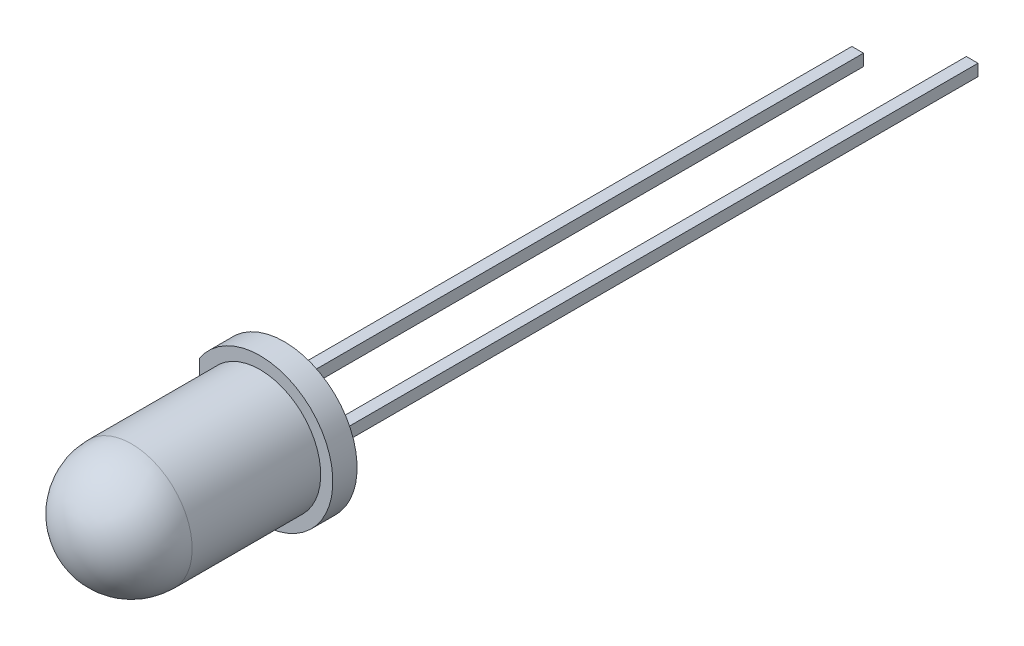
ISO-10303-21;
HEADER;
FILE_DESCRIPTION(('STEP AP214'),'2;1');
FILE_NAME('part.step','',(''),(''),'','','');
FILE_SCHEMA(('AUTOMOTIVE_DESIGN { 1 0 10303 214 1 1 1 1 }'));
ENDSEC;
DATA;
#1=APPLICATION_CONTEXT('core data for automotive mechanical design processes');
#2=APPLICATION_PROTOCOL_DEFINITION('international standard','automotive_design',2000,#1);
#3=PRODUCT_CONTEXT('',#1,'mechanical');
#4=PRODUCT('Part','Part','',(#3));
#5=PRODUCT_RELATED_PRODUCT_CATEGORY('part','',(#4));
#6=PRODUCT_DEFINITION_FORMATION('','',#4);
#7=PRODUCT_DEFINITION_CONTEXT('part definition',#1,'design');
#8=PRODUCT_DEFINITION('design','',#6,#7);
#9=PRODUCT_DEFINITION_SHAPE('','',#8);
#10=(LENGTH_UNIT() NAMED_UNIT(*) SI_UNIT(.MILLI.,.METRE.));
#11=(NAMED_UNIT(*) PLANE_ANGLE_UNIT() SI_UNIT($,.RADIAN.));
#12=(NAMED_UNIT(*) SI_UNIT($,.STERADIAN.) SOLID_ANGLE_UNIT());
#13=UNCERTAINTY_MEASURE_WITH_UNIT(LENGTH_MEASURE(1.E-05),#10,'distance_accuracy_value','');
#14=(GEOMETRIC_REPRESENTATION_CONTEXT(3) GLOBAL_UNCERTAINTY_ASSIGNED_CONTEXT((#13)) GLOBAL_UNIT_ASSIGNED_CONTEXT((#10,
#11,#12)) REPRESENTATION_CONTEXT('',''));
#15=CARTESIAN_POINT('',(0.,0.,0.));
#16=DIRECTION('',(0.,0.,1.));
#17=DIRECTION('',(1.,0.,0.));
#18=AXIS2_PLACEMENT_3D('',#15,#16,#17);
#19=CARTESIAN_POINT('',(-0.0499999999999997,0.,4.26666666666667));
#20=DIRECTION('',(0.,0.,1.));
#21=DIRECTION('',(-1.,0.,0.));
#22=AXIS2_PLACEMENT_3D('',#19,#20,#21);
#23=SPHERICAL_SURFACE('',#22,0.566666666666667);
#24=CARTESIAN_POINT('',(-0.0499999999999997,-0.24,4.26666666666667));
#25=DIRECTION('',(0.,1.,0.));
#26=DIRECTION('',(0.,0.,1.));
#27=AXIS2_PLACEMENT_3D('',#24,#25,#26);
#28=CIRCLE('',#27,0.513333333333333);
#29=CARTESIAN_POINT('',(-0.488634243989226,-0.24,4.));
#30=VERTEX_POINT('',#29);
#31=CARTESIAN_POINT('',(0.388634243989226,-0.24,4.));
#32=VERTEX_POINT('',#31);
#33=EDGE_CURVE('E164',#30,#32,#28,.F.);
#34=ORIENTED_EDGE('',*,*,#33,.T.);
#35=CARTESIAN_POINT('',(-0.0499999999999997,0.,4.));
#36=DIRECTION('',(0.,0.,1.));
#37=DIRECTION('',(1.,0.,0.));
#38=AXIS2_PLACEMENT_3D('',#35,#36,#37);
#39=CIRCLE('',#38,0.5);
#40=EDGE_CURVE('E59',#30,#32,#39,.T.);
#41=ORIENTED_EDGE('',*,*,#40,.F.);
#42=EDGE_LOOP('',(#34,#41));
#43=FACE_BOUND('',#42,.T.);
#44=ADVANCED_FACE('F51',(#43),#23,.T.);
#45=CARTESIAN_POINT('',(0.388634243989226,0.24,4.));
#46=VERTEX_POINT('',#45);
#47=CARTESIAN_POINT('',(-0.488634243989226,0.24,4.));
#48=VERTEX_POINT('',#47);
#49=EDGE_CURVE('E12',#46,#48,#39,.T.);
#50=ORIENTED_EDGE('',*,*,#49,.F.);
#51=CARTESIAN_POINT('',(-0.0499999999999997,0.24,4.26666666666667));
#52=DIRECTION('',(0.,1.,0.));
#53=DIRECTION('',(0.,0.,1.));
#54=AXIS2_PLACEMENT_3D('',#51,#52,#53);
#55=CIRCLE('',#54,0.513333333333333);
#56=EDGE_CURVE('E186',#48,#46,#55,.F.);
#57=ORIENTED_EDGE('',*,*,#56,.F.);
#58=EDGE_LOOP('',(#50,#57));
#59=FACE_BOUND('',#58,.T.);
#60=ADVANCED_FACE('F53',(#59),#23,.T.);
#61=CARTESIAN_POINT('',(-0.55,0.,4.));
#62=DIRECTION('',(0.,0.,-1.));
#63=DIRECTION('',(-1.,0.,0.));
#64=AXIS2_PLACEMENT_3D('',#61,#62,#63);
#65=PLANE('',#64);
#66=CARTESIAN_POINT('',(-0.0499999999999997,0.,4.));
#67=DIRECTION('',(0.,0.,1.));
#68=DIRECTION('',(1.,0.,0.));
#69=AXIS2_PLACEMENT_3D('',#66,#67,#68);
#70=CIRCLE('',#69,0.2);
#71=CARTESIAN_POINT('',(0.15,0.,4.));
#72=VERTEX_POINT('',#71);
#73=EDGE_CURVE('E259',#72,#72,#70,.T.);
#74=ORIENTED_EDGE('',*,*,#73,.F.);
#75=EDGE_LOOP('',(#74));
#76=FACE_BOUND('',#75,.T.);
#77=ORIENTED_EDGE('',*,*,#49,.T.);
#78=DIRECTION('',(1.,0.,0.));
#79=VECTOR('',#78,1.);
#80=CARTESIAN_POINT('',(-1.3,0.24,4.));
#81=LINE('',#80,#79);
#82=CARTESIAN_POINT('',(-1.3,0.24,4.));
#83=VERTEX_POINT('',#82);
#84=EDGE_CURVE('E105',#83,#48,#81,.T.);
#85=ORIENTED_EDGE('',*,*,#84,.F.);
#86=DIRECTION('',(0.,-1.,0.));
#87=VECTOR('',#86,1.);
#88=CARTESIAN_POINT('',(-1.3,0.24,4.));
#89=LINE('',#88,#87);
#90=CARTESIAN_POINT('',(-1.3,-0.24,4.));
#91=VERTEX_POINT('',#90);
#92=EDGE_CURVE('E163',#83,#91,#89,.T.);
#93=ORIENTED_EDGE('',*,*,#92,.T.);
#94=DIRECTION('',(1.,0.,0.));
#95=VECTOR('',#94,1.);
#96=CARTESIAN_POINT('',(-1.3,-0.24,4.));
#97=LINE('',#96,#95);
#98=EDGE_CURVE('E66',#91,#30,#97,.T.);
#99=ORIENTED_EDGE('',*,*,#98,.T.);
#100=ORIENTED_EDGE('',*,*,#40,.T.);
#101=CARTESIAN_POINT('',(1.2,-0.24,4.));
#102=VERTEX_POINT('',#101);
#103=EDGE_CURVE('E149',#32,#102,#97,.T.);
#104=ORIENTED_EDGE('',*,*,#103,.T.);
#105=DIRECTION('',(0.,-1.,0.));
#106=VECTOR('',#105,1.);
#107=CARTESIAN_POINT('',(1.2,0.24,4.));
#108=LINE('',#107,#106);
#109=CARTESIAN_POINT('',(1.2,0.24,4.));
#110=VERTEX_POINT('',#109);
#111=EDGE_CURVE('E133',#110,#102,#108,.T.);
#112=ORIENTED_EDGE('',*,*,#111,.F.);
#113=EDGE_CURVE('E121',#46,#110,#81,.T.);
#114=ORIENTED_EDGE('',*,*,#113,.F.);
#115=EDGE_LOOP('',(#77,#85,#93,#99,#100,#104,#112,#114));
#116=FACE_BOUND('',#115,.T.);
#117=ADVANCED_FACE('F169',(#76,#116),#65,.F.);
#118=CARTESIAN_POINT('',(0.,0.24,0.));
#119=DIRECTION('',(0.,1.,0.));
#120=DIRECTION('',(0.,0.,1.));
#121=AXIS2_PLACEMENT_3D('',#118,#119,#120);
#122=PLANE('',#121);
#123=ORIENTED_EDGE('',*,*,#84,.T.);
#124=ORIENTED_EDGE('',*,*,#56,.T.);
#125=ORIENTED_EDGE('',*,*,#113,.T.);
#126=DIRECTION('',(-0.508148861978286,0.,-0.861269257590315));
#127=VECTOR('',#126,1.);
#128=CARTESIAN_POINT('',(1.2,0.24,4.));
#129=LINE('',#128,#127);
#130=CARTESIAN_POINT('',(0.0199999999999998,0.24,2.));
#131=VERTEX_POINT('',#130);
#132=EDGE_CURVE('E112',#110,#131,#129,.T.);
#133=ORIENTED_EDGE('',*,*,#132,.T.);
#134=DIRECTION('',(-1.,0.,0.));
#135=VECTOR('',#134,1.);
#136=CARTESIAN_POINT('',(0.0199999999999998,0.24,2.));
#137=LINE('',#136,#135);
#138=CARTESIAN_POINT('',(-1.12,0.24,2.));
#139=VERTEX_POINT('',#138);
#140=EDGE_CURVE('E117',#131,#139,#137,.T.);
#141=ORIENTED_EDGE('',*,*,#140,.T.);
#142=DIRECTION('',(0.,0.,-1.));
#143=VECTOR('',#142,1.);
#144=CARTESIAN_POINT('',(-1.12,0.24,2.));
#145=LINE('',#144,#143);
#146=CARTESIAN_POINT('',(-1.12,0.24,-25.));
#147=VERTEX_POINT('',#146);
#148=EDGE_CURVE('E139',#139,#147,#145,.T.);
#149=ORIENTED_EDGE('',*,*,#148,.T.);
#150=DIRECTION('',(1.,0.,0.));
#151=VECTOR('',#150,1.);
#152=CARTESIAN_POINT('',(-1.12,0.24,-25.));
#153=LINE('',#152,#151);
#154=CARTESIAN_POINT('',(-1.6,0.24,-25.));
#155=VERTEX_POINT('',#154);
#156=EDGE_CURVE('E150',#155,#147,#153,.T.);
#157=ORIENTED_EDGE('',*,*,#156,.F.);
#158=DIRECTION('',(0.,0.,1.));
#159=VECTOR('',#158,1.);
#160=CARTESIAN_POINT('',(-1.6,0.24,0.));
#161=LINE('',#160,#159);
#162=CARTESIAN_POINT('',(-1.6,0.24,3.5));
#163=VERTEX_POINT('',#162);
#164=EDGE_CURVE('E75',#155,#163,#161,.T.);
#165=ORIENTED_EDGE('',*,*,#164,.T.);
#166=DIRECTION('',(0.514495755427526,0.,0.857492925712544));
#167=VECTOR('',#166,1.);
#168=CARTESIAN_POINT('',(-1.6,0.24,3.5));
#169=LINE('',#168,#167);
#170=EDGE_CURVE('E159',#163,#83,#169,.T.);
#171=ORIENTED_EDGE('',*,*,#170,.T.);
#172=EDGE_LOOP('',(#123,#124,#125,#133,#141,#149,#157,#165,#171));
#173=FACE_BOUND('',#172,.T.);
#174=ADVANCED_FACE('F114',(#173),#122,.T.);
#175=CARTESIAN_POINT('',(0.,-0.24,0.));
#176=DIRECTION('',(0.,1.,0.));
#177=DIRECTION('',(0.,0.,1.));
#178=AXIS2_PLACEMENT_3D('',#175,#176,#177);
#179=PLANE('',#178);
#180=ORIENTED_EDGE('',*,*,#33,.F.);
#181=ORIENTED_EDGE('',*,*,#98,.F.);
#182=DIRECTION('',(0.514495755427526,0.,0.857492925712544));
#183=VECTOR('',#182,1.);
#184=CARTESIAN_POINT('',(-1.6,-0.24,3.5));
#185=LINE('',#184,#183);
#186=CARTESIAN_POINT('',(-1.6,-0.24,3.5));
#187=VERTEX_POINT('',#186);
#188=EDGE_CURVE('E146',#187,#91,#185,.T.);
#189=ORIENTED_EDGE('',*,*,#188,.F.);
#190=DIRECTION('',(0.,0.,1.));
#191=VECTOR('',#190,1.);
#192=CARTESIAN_POINT('',(-1.6,-0.24,0.));
#193=LINE('',#192,#191);
#194=CARTESIAN_POINT('',(-1.6,-0.24,-25.));
#195=VERTEX_POINT('',#194);
#196=EDGE_CURVE('E99',#195,#187,#193,.T.);
#197=ORIENTED_EDGE('',*,*,#196,.F.);
#198=DIRECTION('',(-1.,0.,0.));
#199=VECTOR('',#198,1.);
#200=CARTESIAN_POINT('',(-1.12,-0.24,-25.));
#201=LINE('',#200,#199);
#202=CARTESIAN_POINT('',(-1.12,-0.24,-25.));
#203=VERTEX_POINT('',#202);
#204=EDGE_CURVE('E207',#203,#195,#201,.T.);
#205=ORIENTED_EDGE('',*,*,#204,.F.);
#206=DIRECTION('',(0.,0.,-1.));
#207=VECTOR('',#206,1.);
#208=CARTESIAN_POINT('',(-1.12,-0.24,2.));
#209=LINE('',#208,#207);
#210=CARTESIAN_POINT('',(-1.12,-0.24,2.));
#211=VERTEX_POINT('',#210);
#212=EDGE_CURVE('E155',#211,#203,#209,.T.);
#213=ORIENTED_EDGE('',*,*,#212,.F.);
#214=DIRECTION('',(-1.,0.,0.));
#215=VECTOR('',#214,1.);
#216=CARTESIAN_POINT('',(0.0199999999999998,-0.24,2.));
#217=LINE('',#216,#215);
#218=CARTESIAN_POINT('',(0.0199999999999998,-0.24,2.));
#219=VERTEX_POINT('',#218);
#220=EDGE_CURVE('E153',#219,#211,#217,.T.);
#221=ORIENTED_EDGE('',*,*,#220,.F.);
#222=DIRECTION('',(-0.508148861978286,0.,-0.861269257590315));
#223=VECTOR('',#222,1.);
#224=CARTESIAN_POINT('',(1.2,-0.24,4.));
#225=LINE('',#224,#223);
#226=EDGE_CURVE('E130',#102,#219,#225,.T.);
#227=ORIENTED_EDGE('',*,*,#226,.F.);
#228=ORIENTED_EDGE('',*,*,#103,.F.);
#229=EDGE_LOOP('',(#180,#181,#189,#197,#205,#213,#221,#227,#228));
#230=FACE_BOUND('',#229,.T.);
#231=ADVANCED_FACE('F221',(#230),#179,.F.);
#232=CARTESIAN_POINT('',(-1.6,0.24,3.5));
#233=DIRECTION('',(0.857492925712544,0.,-0.514495755427526));
#234=DIRECTION('',(-0.514495755427526,0.,-0.857492925712544));
#235=AXIS2_PLACEMENT_3D('',#232,#233,#234);
#236=PLANE('',#235);
#237=ORIENTED_EDGE('',*,*,#188,.T.);
#238=ORIENTED_EDGE('',*,*,#92,.F.);
#239=ORIENTED_EDGE('',*,*,#170,.F.);
#240=DIRECTION('',(0.,-1.,0.));
#241=VECTOR('',#240,1.);
#242=CARTESIAN_POINT('',(-1.6,0.24,3.5));
#243=LINE('',#242,#241);
#244=EDGE_CURVE('E145',#163,#187,#243,.T.);
#245=ORIENTED_EDGE('',*,*,#244,.T.);
#246=EDGE_LOOP('',(#237,#238,#239,#245));
#247=FACE_BOUND('',#246,.T.);
#248=ADVANCED_FACE('F218',(#247),#236,.F.);
#249=CARTESIAN_POINT('',(1.2,0.24,4.));
#250=DIRECTION('',(-0.861269257590315,0.,0.508148861978286));
#251=DIRECTION('',(0.508148861978286,0.,0.861269257590315));
#252=AXIS2_PLACEMENT_3D('',#249,#250,#251);
#253=PLANE('',#252);
#254=ORIENTED_EDGE('',*,*,#226,.T.);
#255=DIRECTION('',(0.,-1.,0.));
#256=VECTOR('',#255,1.);
#257=CARTESIAN_POINT('',(0.0199999999999998,0.24,2.));
#258=LINE('',#257,#256);
#259=EDGE_CURVE('E127',#131,#219,#258,.T.);
#260=ORIENTED_EDGE('',*,*,#259,.F.);
#261=ORIENTED_EDGE('',*,*,#132,.F.);
#262=ORIENTED_EDGE('',*,*,#111,.T.);
#263=EDGE_LOOP('',(#254,#260,#261,#262));
#264=FACE_BOUND('',#263,.T.);
#265=ADVANCED_FACE('F128',(#264),#253,.F.);
#266=CARTESIAN_POINT('',(0.0199999999999998,0.24,2.));
#267=DIRECTION('',(0.,0.,1.));
#268=DIRECTION('',(1.,0.,0.));
#269=AXIS2_PLACEMENT_3D('',#266,#267,#268);
#270=PLANE('',#269);
#271=ORIENTED_EDGE('',*,*,#220,.T.);
#272=DIRECTION('',(0.,-1.,0.));
#273=VECTOR('',#272,1.);
#274=CARTESIAN_POINT('',(-1.12,0.24,2.));
#275=LINE('',#274,#273);
#276=EDGE_CURVE('E134',#139,#211,#275,.T.);
#277=ORIENTED_EDGE('',*,*,#276,.F.);
#278=ORIENTED_EDGE('',*,*,#140,.F.);
#279=ORIENTED_EDGE('',*,*,#259,.T.);
#280=EDGE_LOOP('',(#271,#277,#278,#279));
#281=FACE_BOUND('',#280,.T.);
#282=ADVANCED_FACE('F136',(#281),#270,.F.);
#283=CARTESIAN_POINT('',(-1.12,0.24,2.));
#284=DIRECTION('',(-1.,0.,0.));
#285=DIRECTION('',(0.,0.,1.));
#286=AXIS2_PLACEMENT_3D('',#283,#284,#285);
#287=PLANE('',#286);
#288=ORIENTED_EDGE('',*,*,#212,.T.);
#289=DIRECTION('',(0.,-1.,0.));
#290=VECTOR('',#289,1.);
#291=CARTESIAN_POINT('',(-1.12,-0.24,-25.));
#292=LINE('',#291,#290);
#293=EDGE_CURVE('E201',#147,#203,#292,.T.);
#294=ORIENTED_EDGE('',*,*,#293,.F.);
#295=ORIENTED_EDGE('',*,*,#148,.F.);
#296=ORIENTED_EDGE('',*,*,#276,.T.);
#297=EDGE_LOOP('',(#288,#294,#295,#296));
#298=FACE_BOUND('',#297,.T.);
#299=ADVANCED_FACE('F204',(#298),#287,.F.);
#300=CARTESIAN_POINT('',(-1.6,0.24,0.));
#301=DIRECTION('',(1.,0.,0.));
#302=DIRECTION('',(0.,0.,-1.));
#303=AXIS2_PLACEMENT_3D('',#300,#301,#302);
#304=PLANE('',#303);
#305=ORIENTED_EDGE('',*,*,#196,.T.);
#306=ORIENTED_EDGE('',*,*,#244,.F.);
#307=ORIENTED_EDGE('',*,*,#164,.F.);
#308=DIRECTION('',(0.,1.,0.));
#309=VECTOR('',#308,1.);
#310=CARTESIAN_POINT('',(-1.6,-0.24,-25.));
#311=LINE('',#310,#309);
#312=EDGE_CURVE('E202',#195,#155,#311,.T.);
#313=ORIENTED_EDGE('',*,*,#312,.F.);
#314=EDGE_LOOP('',(#305,#306,#307,#313));
#315=FACE_BOUND('',#314,.T.);
#316=ADVANCED_FACE('F222',(#315),#304,.F.);
#317=CARTESIAN_POINT('',(0.,0.,-25.));
#318=DIRECTION('',(0.,0.,1.));
#319=DIRECTION('',(1.,0.,0.));
#320=AXIS2_PLACEMENT_3D('',#317,#318,#319);
#321=PLANE('',#320);
#322=ORIENTED_EDGE('',*,*,#293,.T.);
#323=ORIENTED_EDGE('',*,*,#204,.T.);
#324=ORIENTED_EDGE('',*,*,#312,.T.);
#325=ORIENTED_EDGE('',*,*,#156,.T.);
#326=EDGE_LOOP('',(#322,#323,#324,#325));
#327=FACE_BOUND('',#326,.T.);
#328=ADVANCED_FACE('F199',(#327),#321,.F.);
#329=CARTESIAN_POINT('',(-0.0499999999999997,0.,3.9));
#330=DIRECTION('',(0.,0.,1.));
#331=DIRECTION('',(1.,0.,0.));
#332=AXIS2_PLACEMENT_3D('',#329,#330,#331);
#333=CYLINDRICAL_SURFACE('',#332,0.2);
#334=CARTESIAN_POINT('',(-0.0499999999999997,0.,3.9));
#335=DIRECTION('',(0.,0.,1.));
#336=DIRECTION('',(1.,0.,0.));
#337=AXIS2_PLACEMENT_3D('',#334,#335,#336);
#338=CIRCLE('',#337,0.2);
#339=CARTESIAN_POINT('',(0.15,0.,3.9));
#340=VERTEX_POINT('',#339);
#341=EDGE_CURVE('E210',#340,#340,#338,.T.);
#342=ORIENTED_EDGE('',*,*,#341,.F.);
#343=EDGE_LOOP('',(#342));
#344=FACE_BOUND('',#343,.T.);
#345=ORIENTED_EDGE('',*,*,#73,.T.);
#346=EDGE_LOOP('',(#345));
#347=FACE_BOUND('',#346,.T.);
#348=ADVANCED_FACE('F229',(#344,#347),#333,.F.);
#349=CARTESIAN_POINT('',(-0.0499999999999997,0.,3.9));
#350=DIRECTION('',(0.,0.,1.));
#351=DIRECTION('',(1.,0.,0.));
#352=AXIS2_PLACEMENT_3D('',#349,#350,#351);
#353=PLANE('',#352);
#354=ORIENTED_EDGE('',*,*,#341,.T.);
#355=EDGE_LOOP('',(#354));
#356=FACE_BOUND('',#355,.T.);
#357=ADVANCED_FACE('F251',(#356),#353,.T.);
#358=CLOSED_SHELL('',(#44,#60,#117,#174,#231,#248,#265,#282,#299,#316,#328,#348,#357));
#359=MANIFOLD_SOLID_BREP('B2',#358);
#360=CARTESIAN_POINT('',(1.12,0.24,2.));
#361=DIRECTION('',(0.,0.,1.));
#362=DIRECTION('',(1.,0.,0.));
#363=AXIS2_PLACEMENT_3D('',#360,#361,#362);
#364=PLANE('',#363);
#365=DIRECTION('',(-1.,0.,0.));
#366=VECTOR('',#365,1.);
#367=CARTESIAN_POINT('',(1.12,-0.24,2.));
#368=LINE('',#367,#366);
#369=CARTESIAN_POINT('',(1.12,-0.24,2.));
#370=VERTEX_POINT('',#369);
#371=CARTESIAN_POINT('',(0.22,-0.24,2.));
#372=VERTEX_POINT('',#371);
#373=EDGE_CURVE('E456',#370,#372,#368,.T.);
#374=ORIENTED_EDGE('',*,*,#373,.T.);
#375=DIRECTION('',(0.,-1.,0.));
#376=VECTOR('',#375,1.);
#377=CARTESIAN_POINT('',(0.22,0.24,2.));
#378=LINE('',#377,#376);
#379=CARTESIAN_POINT('',(0.22,0.24,2.));
#380=VERTEX_POINT('',#379);
#381=EDGE_CURVE('E49',#380,#372,#378,.T.);
#382=ORIENTED_EDGE('',*,*,#381,.F.);
#383=DIRECTION('',(-1.,0.,0.));
#384=VECTOR('',#383,1.);
#385=CARTESIAN_POINT('',(1.12,0.24,2.));
#386=LINE('',#385,#384);
#387=CARTESIAN_POINT('',(1.12,0.24,2.));
#388=VERTEX_POINT('',#387);
#389=EDGE_CURVE('E457',#388,#380,#386,.T.);
#390=ORIENTED_EDGE('',*,*,#389,.F.);
#391=DIRECTION('',(0.,-1.,0.));
#392=VECTOR('',#391,1.);
#393=CARTESIAN_POINT('',(1.12,0.24,2.));
#394=LINE('',#393,#392);
#395=EDGE_CURVE('E462',#388,#370,#394,.T.);
#396=ORIENTED_EDGE('',*,*,#395,.T.);
#397=EDGE_LOOP('',(#374,#382,#390,#396));
#398=FACE_BOUND('',#397,.T.);
#399=ADVANCED_FACE('F370',(#398),#364,.F.);
#400=CARTESIAN_POINT('',(0.22,0.24,2.));
#401=DIRECTION('',(0.861269257590315,0.,-0.508148861978286));
#402=DIRECTION('',(-0.508148861978286,0.,-0.861269257590315));
#403=AXIS2_PLACEMENT_3D('',#400,#401,#402);
#404=PLANE('',#403);
#405=DIRECTION('',(0.508148861978286,0.,0.861269257590315));
#406=VECTOR('',#405,1.);
#407=CARTESIAN_POINT('',(0.22,-0.24,2.));
#408=LINE('',#407,#406);
#409=CARTESIAN_POINT('',(1.4,-0.24,4.));
#410=VERTEX_POINT('',#409);
#411=EDGE_CURVE('E465',#372,#410,#408,.T.);
#412=ORIENTED_EDGE('',*,*,#411,.T.);
#413=DIRECTION('',(0.,-1.,0.));
#414=VECTOR('',#413,1.);
#415=CARTESIAN_POINT('',(1.4,0.24,4.));
#416=LINE('',#415,#414);
#417=CARTESIAN_POINT('',(1.4,0.24,4.));
#418=VERTEX_POINT('',#417);
#419=EDGE_CURVE('E378',#418,#410,#416,.T.);
#420=ORIENTED_EDGE('',*,*,#419,.F.);
#421=DIRECTION('',(0.508148861978286,0.,0.861269257590315));
#422=VECTOR('',#421,1.);
#423=CARTESIAN_POINT('',(0.22,0.24,2.));
#424=LINE('',#423,#422);
#425=EDGE_CURVE('E419',#380,#418,#424,.T.);
#426=ORIENTED_EDGE('',*,*,#425,.F.);
#427=ORIENTED_EDGE('',*,*,#381,.T.);
#428=EDGE_LOOP('',(#412,#420,#426,#427));
#429=FACE_BOUND('',#428,.T.);
#430=ADVANCED_FACE('F480',(#429),#404,.F.);
#431=CARTESIAN_POINT('',(1.4,0.24,4.));
#432=DIRECTION('',(0.,0.,-1.));
#433=DIRECTION('',(-1.,0.,0.));
#434=AXIS2_PLACEMENT_3D('',#431,#432,#433);
#435=PLANE('',#434);
#436=DIRECTION('',(1.,0.,0.));
#437=VECTOR('',#436,1.);
#438=CARTESIAN_POINT('',(1.4,-0.24,4.));
#439=LINE('',#438,#437);
#440=CARTESIAN_POINT('',(1.6,-0.24,4.));
#441=VERTEX_POINT('',#440);
#442=EDGE_CURVE('E405',#410,#441,#439,.T.);
#443=ORIENTED_EDGE('',*,*,#442,.T.);
#444=DIRECTION('',(0.,-1.,0.));
#445=VECTOR('',#444,1.);
#446=CARTESIAN_POINT('',(1.6,0.24,4.));
#447=LINE('',#446,#445);
#448=CARTESIAN_POINT('',(1.6,0.24,4.));
#449=VERTEX_POINT('',#448);
#450=EDGE_CURVE('E471',#449,#441,#447,.T.);
#451=ORIENTED_EDGE('',*,*,#450,.F.);
#452=DIRECTION('',(1.,0.,0.));
#453=VECTOR('',#452,1.);
#454=CARTESIAN_POINT('',(1.4,0.24,4.));
#455=LINE('',#454,#453);
#456=EDGE_CURVE('E436',#418,#449,#455,.T.);
#457=ORIENTED_EDGE('',*,*,#456,.F.);
#458=ORIENTED_EDGE('',*,*,#419,.T.);
#459=EDGE_LOOP('',(#443,#451,#457,#458));
#460=FACE_BOUND('',#459,.T.);
#461=ADVANCED_FACE('F472',(#460),#435,.F.);
#462=CARTESIAN_POINT('',(1.6,0.24,4.));
#463=DIRECTION('',(-1.,0.,0.));
#464=DIRECTION('',(0.,0.,1.));
#465=AXIS2_PLACEMENT_3D('',#462,#463,#464);
#466=PLANE('',#465);
#467=DIRECTION('',(0.,0.,-1.));
#468=VECTOR('',#467,1.);
#469=CARTESIAN_POINT('',(1.6,-0.24,4.));
#470=LINE('',#469,#468);
#471=CARTESIAN_POINT('',(1.6,-0.24,-27.));
#472=VERTEX_POINT('',#471);
#473=EDGE_CURVE('E443',#441,#472,#470,.T.);
#474=ORIENTED_EDGE('',*,*,#473,.T.);
#475=DIRECTION('',(0.,-1.,0.));
#476=VECTOR('',#475,1.);
#477=CARTESIAN_POINT('',(1.6,0.24,-27.));
#478=LINE('',#477,#476);
#479=CARTESIAN_POINT('',(1.6,0.24,-27.));
#480=VERTEX_POINT('',#479);
#481=EDGE_CURVE('E440',#480,#472,#478,.T.);
#482=ORIENTED_EDGE('',*,*,#481,.F.);
#483=DIRECTION('',(0.,0.,-1.));
#484=VECTOR('',#483,1.);
#485=CARTESIAN_POINT('',(1.6,0.24,4.));
#486=LINE('',#485,#484);
#487=EDGE_CURVE('E430',#449,#480,#486,.T.);
#488=ORIENTED_EDGE('',*,*,#487,.F.);
#489=ORIENTED_EDGE('',*,*,#450,.T.);
#490=EDGE_LOOP('',(#474,#482,#488,#489));
#491=FACE_BOUND('',#490,.T.);
#492=ADVANCED_FACE('F441',(#491),#466,.F.);
#493=CARTESIAN_POINT('',(1.12,0.24,0.));
#494=DIRECTION('',(1.,0.,0.));
#495=DIRECTION('',(0.,0.,-1.));
#496=AXIS2_PLACEMENT_3D('',#493,#494,#495);
#497=PLANE('',#496);
#498=DIRECTION('',(0.,0.,1.));
#499=VECTOR('',#498,1.);
#500=CARTESIAN_POINT('',(1.12,-0.24,0.));
#501=LINE('',#500,#499);
#502=CARTESIAN_POINT('',(1.12,-0.24,-27.));
#503=VERTEX_POINT('',#502);
#504=EDGE_CURVE('E412',#503,#370,#501,.T.);
#505=ORIENTED_EDGE('',*,*,#504,.T.);
#506=ORIENTED_EDGE('',*,*,#395,.F.);
#507=DIRECTION('',(0.,0.,1.));
#508=VECTOR('',#507,1.);
#509=CARTESIAN_POINT('',(1.12,0.24,0.));
#510=LINE('',#509,#508);
#511=CARTESIAN_POINT('',(1.12,0.24,-27.));
#512=VERTEX_POINT('',#511);
#513=EDGE_CURVE('E386',#512,#388,#510,.T.);
#514=ORIENTED_EDGE('',*,*,#513,.F.);
#515=DIRECTION('',(0.,1.,0.));
#516=VECTOR('',#515,1.);
#517=CARTESIAN_POINT('',(1.12,-0.24,-27.));
#518=LINE('',#517,#516);
#519=EDGE_CURVE('E451',#503,#512,#518,.T.);
#520=ORIENTED_EDGE('',*,*,#519,.F.);
#521=EDGE_LOOP('',(#505,#506,#514,#520));
#522=FACE_BOUND('',#521,.T.);
#523=ADVANCED_FACE('F476',(#522),#497,.F.);
#524=CARTESIAN_POINT('',(0.,0.24,0.));
#525=DIRECTION('',(0.,-1.,0.));
#526=DIRECTION('',(0.,0.,-1.));
#527=AXIS2_PLACEMENT_3D('',#524,#525,#526);
#528=PLANE('',#527);
#529=ORIENTED_EDGE('',*,*,#389,.T.);
#530=ORIENTED_EDGE('',*,*,#425,.T.);
#531=ORIENTED_EDGE('',*,*,#456,.T.);
#532=ORIENTED_EDGE('',*,*,#487,.T.);
#533=DIRECTION('',(1.,0.,0.));
#534=VECTOR('',#533,1.);
#535=CARTESIAN_POINT('',(1.12,0.24,-27.));
#536=LINE('',#535,#534);
#537=EDGE_CURVE('E434',#512,#480,#536,.T.);
#538=ORIENTED_EDGE('',*,*,#537,.F.);
#539=ORIENTED_EDGE('',*,*,#513,.T.);
#540=EDGE_LOOP('',(#529,#530,#531,#532,#538,#539));
#541=FACE_BOUND('',#540,.T.);
#542=ADVANCED_FACE('F432',(#541),#528,.F.);
#543=CARTESIAN_POINT('',(0.,-0.24,0.));
#544=DIRECTION('',(0.,-1.,0.));
#545=DIRECTION('',(0.,0.,-1.));
#546=AXIS2_PLACEMENT_3D('',#543,#544,#545);
#547=PLANE('',#546);
#548=ORIENTED_EDGE('',*,*,#373,.F.);
#549=ORIENTED_EDGE('',*,*,#504,.F.);
#550=DIRECTION('',(-1.,0.,0.));
#551=VECTOR('',#550,1.);
#552=CARTESIAN_POINT('',(1.6,-0.24,-27.));
#553=LINE('',#552,#551);
#554=EDGE_CURVE('E447',#472,#503,#553,.T.);
#555=ORIENTED_EDGE('',*,*,#554,.F.);
#556=ORIENTED_EDGE('',*,*,#473,.F.);
#557=ORIENTED_EDGE('',*,*,#442,.F.);
#558=ORIENTED_EDGE('',*,*,#411,.F.);
#559=EDGE_LOOP('',(#548,#549,#555,#556,#557,#558));
#560=FACE_BOUND('',#559,.T.);
#561=ADVANCED_FACE('F475',(#560),#547,.T.);
#562=CARTESIAN_POINT('',(0.,0.,-27.));
#563=DIRECTION('',(0.,0.,-1.));
#564=DIRECTION('',(-1.,0.,0.));
#565=AXIS2_PLACEMENT_3D('',#562,#563,#564);
#566=PLANE('',#565);
#567=ORIENTED_EDGE('',*,*,#537,.T.);
#568=ORIENTED_EDGE('',*,*,#481,.T.);
#569=ORIENTED_EDGE('',*,*,#554,.T.);
#570=ORIENTED_EDGE('',*,*,#519,.T.);
#571=EDGE_LOOP('',(#567,#568,#569,#570));
#572=FACE_BOUND('',#571,.T.);
#573=ADVANCED_FACE('F450',(#572),#566,.T.);
#574=CLOSED_SHELL('',(#399,#430,#461,#492,#523,#542,#561,#573));
#575=MANIFOLD_SOLID_BREP('B6',#574);
#576=CARTESIAN_POINT('',(0.,0.,1.));
#577=DIRECTION('',(0.,0.,-1.));
#578=DIRECTION('',(-1.,0.,0.));
#579=AXIS2_PLACEMENT_3D('',#576,#577,#578);
#580=CYLINDRICAL_SURFACE('',#579,3.);
#581=CARTESIAN_POINT('',(0.,0.,1.));
#582=DIRECTION('',(0.,0.,1.));
#583=DIRECTION('',(1.,0.,0.));
#584=AXIS2_PLACEMENT_3D('',#581,#582,#583);
#585=CIRCLE('',#584,3.);
#586=CARTESIAN_POINT('',(-2.5,-1.6583123951777,1.));
#587=VERTEX_POINT('',#586);
#588=CARTESIAN_POINT('',(-2.5,1.6583123951777,1.));
#589=VERTEX_POINT('',#588);
#590=EDGE_CURVE('E581',#587,#589,#585,.T.);
#591=ORIENTED_EDGE('',*,*,#590,.F.);
#592=DIRECTION('',(0.,0.,-1.));
#593=VECTOR('',#592,1.);
#594=CARTESIAN_POINT('',(-2.5,-1.6583123951777,4.35410196624969));
#595=LINE('',#594,#593);
#596=CARTESIAN_POINT('',(-2.5,-1.6583123951777,0.));
#597=VERTEX_POINT('',#596);
#598=EDGE_CURVE('E771',#587,#597,#595,.T.);
#599=ORIENTED_EDGE('',*,*,#598,.T.);
#600=CARTESIAN_POINT('',(0.,0.,0.));
#601=DIRECTION('',(0.,0.,1.));
#602=DIRECTION('',(1.,0.,0.));
#603=AXIS2_PLACEMENT_3D('',#600,#601,#602);
#604=CIRCLE('',#603,3.);
#605=CARTESIAN_POINT('',(-2.5,1.6583123951777,0.));
#606=VERTEX_POINT('',#605);
#607=EDGE_CURVE('E779',#597,#606,#604,.T.);
#608=ORIENTED_EDGE('',*,*,#607,.T.);
#609=DIRECTION('',(0.,0.,-1.));
#610=VECTOR('',#609,1.);
#611=CARTESIAN_POINT('',(-2.5,1.6583123951777,4.35410196624969));
#612=LINE('',#611,#610);
#613=EDGE_CURVE('E774',#589,#606,#612,.T.);
#614=ORIENTED_EDGE('',*,*,#613,.F.);
#615=EDGE_LOOP('',(#591,#599,#608,#614));
#616=FACE_BOUND('',#615,.T.);
#617=ADVANCED_FACE('F574',(#616),#580,.T.);
#618=CARTESIAN_POINT('',(0.,0.,1.));
#619=DIRECTION('',(0.,0.,1.));
#620=DIRECTION('',(1.,0.,0.));
#621=AXIS2_PLACEMENT_3D('',#618,#619,#620);
#622=PLANE('',#621);
#623=DIRECTION('',(0.,-1.,0.));
#624=VECTOR('',#623,1.);
#625=CARTESIAN_POINT('',(-2.5,1.6583123951777,1.));
#626=LINE('',#625,#624);
#627=CARTESIAN_POINT('',(-2.5,0.,1.));
#628=VERTEX_POINT('',#627);
#629=EDGE_CURVE('E766',#628,#587,#626,.T.);
#630=ORIENTED_EDGE('',*,*,#629,.T.);
#631=ORIENTED_EDGE('',*,*,#590,.T.);
#632=EDGE_CURVE('E768',#589,#628,#626,.T.);
#633=ORIENTED_EDGE('',*,*,#632,.T.);
#634=CARTESIAN_POINT('',(0.,0.,1.));
#635=DIRECTION('',(0.,0.,1.));
#636=DIRECTION('',(1.,0.,0.));
#637=AXIS2_PLACEMENT_3D('',#634,#635,#636);
#638=CIRCLE('',#637,2.5);
#639=EDGE_CURVE('E368',#628,#628,#638,.T.);
#640=ORIENTED_EDGE('',*,*,#639,.F.);
#641=EDGE_LOOP('',(#630,#631,#633,#640));
#642=FACE_BOUND('',#641,.T.);
#643=ADVANCED_FACE('F793',(#642),#622,.T.);
#644=CARTESIAN_POINT('',(0.,0.,0.));
#645=DIRECTION('',(0.,0.,1.));
#646=DIRECTION('',(1.,0.,0.));
#647=AXIS2_PLACEMENT_3D('',#644,#645,#646);
#648=PLANE('',#647);
#649=DIRECTION('',(0.,1.,0.));
#650=VECTOR('',#649,1.);
#651=CARTESIAN_POINT('',(-1.6,-0.24,0.));
#652=LINE('',#651,#650);
#653=CARTESIAN_POINT('',(-1.6,-0.24,0.));
#654=VERTEX_POINT('',#653);
#655=CARTESIAN_POINT('',(-1.6,0.24,0.));
#656=VERTEX_POINT('',#655);
#657=EDGE_CURVE('E688',#654,#656,#652,.T.);
#658=ORIENTED_EDGE('',*,*,#657,.F.);
#659=DIRECTION('',(-1.,0.,0.));
#660=VECTOR('',#659,1.);
#661=CARTESIAN_POINT('',(-1.6,-0.24,0.));
#662=LINE('',#661,#660);
#663=CARTESIAN_POINT('',(-1.12,-0.24,0.));
#664=VERTEX_POINT('',#663);
#665=EDGE_CURVE('E695',#664,#654,#662,.T.);
#666=ORIENTED_EDGE('',*,*,#665,.F.);
#667=DIRECTION('',(0.,1.,0.));
#668=VECTOR('',#667,1.);
#669=CARTESIAN_POINT('',(-1.12,-0.24,0.));
#670=LINE('',#669,#668);
#671=CARTESIAN_POINT('',(-1.12,0.24,0.));
#672=VERTEX_POINT('',#671);
#673=EDGE_CURVE('E767',#664,#672,#670,.T.);
#674=ORIENTED_EDGE('',*,*,#673,.T.);
#675=DIRECTION('',(-1.,0.,0.));
#676=VECTOR('',#675,1.);
#677=CARTESIAN_POINT('',(-1.6,0.24,0.));
#678=LINE('',#677,#676);
#679=EDGE_CURVE('E709',#672,#656,#678,.T.);
#680=ORIENTED_EDGE('',*,*,#679,.T.);
#681=EDGE_LOOP('',(#658,#666,#674,#680));
#682=FACE_BOUND('',#681,.T.);
#683=DIRECTION('',(0.,1.,0.));
#684=VECTOR('',#683,1.);
#685=CARTESIAN_POINT('',(1.12,-0.24,0.));
#686=LINE('',#685,#684);
#687=CARTESIAN_POINT('',(1.12,-0.24,0.));
#688=VERTEX_POINT('',#687);
#689=CARTESIAN_POINT('',(1.12,0.24,0.));
#690=VERTEX_POINT('',#689);
#691=EDGE_CURVE('E736',#688,#690,#686,.T.);
#692=ORIENTED_EDGE('',*,*,#691,.F.);
#693=DIRECTION('',(-1.,0.,0.));
#694=VECTOR('',#693,1.);
#695=CARTESIAN_POINT('',(1.12,-0.24,0.));
#696=LINE('',#695,#694);
#697=CARTESIAN_POINT('',(1.6,-0.24,0.));
#698=VERTEX_POINT('',#697);
#699=EDGE_CURVE('E717',#698,#688,#696,.T.);
#700=ORIENTED_EDGE('',*,*,#699,.F.);
#701=DIRECTION('',(0.,1.,0.));
#702=VECTOR('',#701,1.);
#703=CARTESIAN_POINT('',(1.6,-0.24,0.));
#704=LINE('',#703,#702);
#705=CARTESIAN_POINT('',(1.6,0.24,0.));
#706=VERTEX_POINT('',#705);
#707=EDGE_CURVE('E752',#698,#706,#704,.T.);
#708=ORIENTED_EDGE('',*,*,#707,.T.);
#709=DIRECTION('',(-1.,0.,0.));
#710=VECTOR('',#709,1.);
#711=CARTESIAN_POINT('',(1.12,0.24,0.));
#712=LINE('',#711,#710);
#713=EDGE_CURVE('E737',#706,#690,#712,.T.);
#714=ORIENTED_EDGE('',*,*,#713,.T.);
#715=EDGE_LOOP('',(#692,#700,#708,#714));
#716=FACE_BOUND('',#715,.T.);
#717=ORIENTED_EDGE('',*,*,#607,.F.);
#718=DIRECTION('',(0.,-1.,0.));
#719=VECTOR('',#718,1.);
#720=CARTESIAN_POINT('',(-2.5,1.6583123951777,0.));
#721=LINE('',#720,#719);
#722=EDGE_CURVE('E764',#606,#597,#721,.T.);
#723=ORIENTED_EDGE('',*,*,#722,.F.);
#724=EDGE_LOOP('',(#717,#723));
#725=FACE_BOUND('',#724,.T.);
#726=ADVANCED_FACE('F707',(#682,#716,#725),#648,.F.);
#727=CARTESIAN_POINT('',(0.,0.,6.3));
#728=DIRECTION('',(0.,0.,-1.));
#729=DIRECTION('',(0.,1.,0.));
#730=AXIS2_PLACEMENT_3D('',#727,#728,#729);
#731=SPHERICAL_SURFACE('',#730,2.5);
#732=CARTESIAN_POINT('',(0.,0.,6.3));
#733=DIRECTION('',(0.,0.,-1.));
#734=DIRECTION('',(0.,1.,0.));
#735=AXIS2_PLACEMENT_3D('',#732,#733,#734);
#736=CIRCLE('',#735,2.5);
#737=CARTESIAN_POINT('',(0.,2.5,6.3));
#738=VERTEX_POINT('',#737);
#739=EDGE_CURVE('E776',#738,#738,#736,.T.);
#740=ORIENTED_EDGE('',*,*,#739,.F.);
#741=EDGE_LOOP('',(#740));
#742=FACE_BOUND('',#741,.T.);
#743=ADVANCED_FACE('F797',(#742),#731,.T.);
#744=CARTESIAN_POINT('',(0.,0.,1.));
#745=DIRECTION('',(0.,0.,-1.));
#746=DIRECTION('',(0.,1.,0.));
#747=AXIS2_PLACEMENT_3D('',#744,#745,#746);
#748=CYLINDRICAL_SURFACE('',#747,2.5);
#749=ORIENTED_EDGE('',*,*,#739,.T.);
#750=EDGE_LOOP('',(#749));
#751=FACE_BOUND('',#750,.T.);
#752=ORIENTED_EDGE('',*,*,#639,.T.);
#753=EDGE_LOOP('',(#752));
#754=FACE_BOUND('',#753,.T.);
#755=ADVANCED_FACE('F795',(#751,#754),#748,.T.);
#756=CARTESIAN_POINT('',(-2.5,1.6583123951777,4.35410196624969));
#757=DIRECTION('',(1.,0.,0.));
#758=DIRECTION('',(0.,0.,-1.));
#759=AXIS2_PLACEMENT_3D('',#756,#757,#758);
#760=PLANE('',#759);
#761=ORIENTED_EDGE('',*,*,#613,.T.);
#762=ORIENTED_EDGE('',*,*,#722,.T.);
#763=ORIENTED_EDGE('',*,*,#598,.F.);
#764=ORIENTED_EDGE('',*,*,#629,.F.);
#765=ORIENTED_EDGE('',*,*,#632,.F.);
#766=EDGE_LOOP('',(#761,#762,#763,#764,#765));
#767=FACE_BOUND('',#766,.T.);
#768=ADVANCED_FACE('F789',(#767),#760,.F.);
#769=CARTESIAN_POINT('',(1.6,-0.24,0.));
#770=DIRECTION('',(1.,0.,0.));
#771=DIRECTION('',(0.,0.,-1.));
#772=AXIS2_PLACEMENT_3D('',#769,#770,#771);
#773=PLANE('',#772);
#774=DIRECTION('',(0.,0.,-1.));
#775=VECTOR('',#774,1.);
#776=CARTESIAN_POINT('',(1.6,0.24,0.));
#777=LINE('',#776,#775);
#778=CARTESIAN_POINT('',(1.6,0.24,4.));
#779=VERTEX_POINT('',#778);
#780=EDGE_CURVE('E721',#779,#706,#777,.T.);
#781=ORIENTED_EDGE('',*,*,#780,.T.);
#782=ORIENTED_EDGE('',*,*,#707,.F.);
#783=DIRECTION('',(0.,0.,-1.));
#784=VECTOR('',#783,1.);
#785=CARTESIAN_POINT('',(1.6,-0.24,0.));
#786=LINE('',#785,#784);
#787=CARTESIAN_POINT('',(1.6,-0.24,4.));
#788=VERTEX_POINT('',#787);
#789=EDGE_CURVE('E733',#788,#698,#786,.T.);
#790=ORIENTED_EDGE('',*,*,#789,.F.);
#791=DIRECTION('',(0.,1.,0.));
#792=VECTOR('',#791,1.);
#793=CARTESIAN_POINT('',(1.6,-0.24,4.));
#794=LINE('',#793,#792);
#795=EDGE_CURVE('E755',#788,#779,#794,.T.);
#796=ORIENTED_EDGE('',*,*,#795,.T.);
#797=EDGE_LOOP('',(#781,#782,#790,#796));
#798=FACE_BOUND('',#797,.T.);
#799=ADVANCED_FACE('F804',(#798),#773,.F.);
#800=CARTESIAN_POINT('',(1.6,-0.24,4.));
#801=DIRECTION('',(0.,0.,1.));
#802=DIRECTION('',(1.,0.,0.));
#803=AXIS2_PLACEMENT_3D('',#800,#801,#802);
#804=PLANE('',#803);
#805=DIRECTION('',(1.,0.,0.));
#806=VECTOR('',#805,1.);
#807=CARTESIAN_POINT('',(1.6,0.24,4.));
#808=LINE('',#807,#806);
#809=CARTESIAN_POINT('',(1.4,0.24,4.));
#810=VERTEX_POINT('',#809);
#811=EDGE_CURVE('E747',#810,#779,#808,.T.);
#812=ORIENTED_EDGE('',*,*,#811,.T.);
#813=ORIENTED_EDGE('',*,*,#795,.F.);
#814=DIRECTION('',(1.,0.,0.));
#815=VECTOR('',#814,1.);
#816=CARTESIAN_POINT('',(1.6,-0.24,4.));
#817=LINE('',#816,#815);
#818=CARTESIAN_POINT('',(1.4,-0.24,4.));
#819=VERTEX_POINT('',#818);
#820=EDGE_CURVE('E730',#819,#788,#817,.T.);
#821=ORIENTED_EDGE('',*,*,#820,.F.);
#822=DIRECTION('',(0.,1.,0.));
#823=VECTOR('',#822,1.);
#824=CARTESIAN_POINT('',(1.4,-0.24,4.));
#825=LINE('',#824,#823);
#826=EDGE_CURVE('E757',#819,#810,#825,.T.);
#827=ORIENTED_EDGE('',*,*,#826,.T.);
#828=EDGE_LOOP('',(#812,#813,#821,#827));
#829=FACE_BOUND('',#828,.T.);
#830=ADVANCED_FACE('F849',(#829),#804,.F.);
#831=CARTESIAN_POINT('',(1.4,-0.24,4.));
#832=DIRECTION('',(-0.861269257590315,0.,0.508148861978286));
#833=DIRECTION('',(0.508148861978286,0.,0.861269257590315));
#834=AXIS2_PLACEMENT_3D('',#831,#832,#833);
#835=PLANE('',#834);
#836=DIRECTION('',(0.508148861978286,0.,0.861269257590315));
#837=VECTOR('',#836,1.);
#838=CARTESIAN_POINT('',(1.4,0.24,4.));
#839=LINE('',#838,#837);
#840=CARTESIAN_POINT('',(0.22,0.24,2.));
#841=VERTEX_POINT('',#840);
#842=EDGE_CURVE('E744',#841,#810,#839,.T.);
#843=ORIENTED_EDGE('',*,*,#842,.T.);
#844=ORIENTED_EDGE('',*,*,#826,.F.);
#845=DIRECTION('',(0.508148861978286,0.,0.861269257590315));
#846=VECTOR('',#845,1.);
#847=CARTESIAN_POINT('',(1.4,-0.24,4.));
#848=LINE('',#847,#846);
#849=CARTESIAN_POINT('',(0.22,-0.24,2.));
#850=VERTEX_POINT('',#849);
#851=EDGE_CURVE('E727',#850,#819,#848,.T.);
#852=ORIENTED_EDGE('',*,*,#851,.F.);
#853=DIRECTION('',(0.,1.,0.));
#854=VECTOR('',#853,1.);
#855=CARTESIAN_POINT('',(0.22,-0.24,2.));
#856=LINE('',#855,#854);
#857=EDGE_CURVE('E759',#850,#841,#856,.T.);
#858=ORIENTED_EDGE('',*,*,#857,.T.);
#859=EDGE_LOOP('',(#843,#844,#852,#858));
#860=FACE_BOUND('',#859,.T.);
#861=ADVANCED_FACE('F856',(#860),#835,.F.);
#862=CARTESIAN_POINT('',(0.22,-0.24,2.));
#863=DIRECTION('',(0.,0.,-1.));
#864=DIRECTION('',(-1.,0.,0.));
#865=AXIS2_PLACEMENT_3D('',#862,#863,#864);
#866=PLANE('',#865);
#867=DIRECTION('',(-1.,0.,0.));
#868=VECTOR('',#867,1.);
#869=CARTESIAN_POINT('',(0.22,0.24,2.));
#870=LINE('',#869,#868);
#871=CARTESIAN_POINT('',(1.12,0.24,2.));
#872=VERTEX_POINT('',#871);
#873=EDGE_CURVE('E741',#872,#841,#870,.T.);
#874=ORIENTED_EDGE('',*,*,#873,.T.);
#875=ORIENTED_EDGE('',*,*,#857,.F.);
#876=DIRECTION('',(-1.,0.,0.));
#877=VECTOR('',#876,1.);
#878=CARTESIAN_POINT('',(0.22,-0.24,2.));
#879=LINE('',#878,#877);
#880=CARTESIAN_POINT('',(1.12,-0.24,2.));
#881=VERTEX_POINT('',#880);
#882=EDGE_CURVE('E724',#881,#850,#879,.T.);
#883=ORIENTED_EDGE('',*,*,#882,.F.);
#884=DIRECTION('',(0.,1.,0.));
#885=VECTOR('',#884,1.);
#886=CARTESIAN_POINT('',(1.12,-0.24,2.));
#887=LINE('',#886,#885);
#888=EDGE_CURVE('E761',#881,#872,#887,.T.);
#889=ORIENTED_EDGE('',*,*,#888,.T.);
#890=EDGE_LOOP('',(#874,#875,#883,#889));
#891=FACE_BOUND('',#890,.T.);
#892=ADVANCED_FACE('F864',(#891),#866,.F.);
#893=CARTESIAN_POINT('',(1.12,-0.24,2.));
#894=DIRECTION('',(-1.,0.,0.));
#895=DIRECTION('',(0.,0.,1.));
#896=AXIS2_PLACEMENT_3D('',#893,#894,#895);
#897=PLANE('',#896);
#898=DIRECTION('',(0.,0.,1.));
#899=VECTOR('',#898,1.);
#900=CARTESIAN_POINT('',(1.12,0.24,2.));
#901=LINE('',#900,#899);
#902=EDGE_CURVE('E596',#690,#872,#901,.T.);
#903=ORIENTED_EDGE('',*,*,#902,.T.);
#904=ORIENTED_EDGE('',*,*,#888,.F.);
#905=DIRECTION('',(0.,0.,1.));
#906=VECTOR('',#905,1.);
#907=CARTESIAN_POINT('',(1.12,-0.24,2.));
#908=LINE('',#907,#906);
#909=EDGE_CURVE('E720',#688,#881,#908,.T.);
#910=ORIENTED_EDGE('',*,*,#909,.F.);
#911=ORIENTED_EDGE('',*,*,#691,.T.);
#912=EDGE_LOOP('',(#903,#904,#910,#911));
#913=FACE_BOUND('',#912,.T.);
#914=ADVANCED_FACE('F872',(#913),#897,.F.);
#915=CARTESIAN_POINT('',(0.,-0.24,0.));
#916=DIRECTION('',(0.,-1.,0.));
#917=DIRECTION('',(0.,0.,-1.));
#918=AXIS2_PLACEMENT_3D('',#915,#916,#917);
#919=PLANE('',#918);
#920=ORIENTED_EDGE('',*,*,#699,.T.);
#921=ORIENTED_EDGE('',*,*,#909,.T.);
#922=ORIENTED_EDGE('',*,*,#882,.T.);
#923=ORIENTED_EDGE('',*,*,#851,.T.);
#924=ORIENTED_EDGE('',*,*,#820,.T.);
#925=ORIENTED_EDGE('',*,*,#789,.T.);
#926=EDGE_LOOP('',(#920,#921,#922,#923,#924,#925));
#927=FACE_BOUND('',#926,.T.);
#928=ADVANCED_FACE('F880',(#927),#919,.F.);
#929=CARTESIAN_POINT('',(0.,0.24,0.));
#930=DIRECTION('',(0.,-1.,0.));
#931=DIRECTION('',(0.,0.,-1.));
#932=AXIS2_PLACEMENT_3D('',#929,#930,#931);
#933=PLANE('',#932);
#934=ORIENTED_EDGE('',*,*,#713,.F.);
#935=ORIENTED_EDGE('',*,*,#780,.F.);
#936=ORIENTED_EDGE('',*,*,#811,.F.);
#937=ORIENTED_EDGE('',*,*,#842,.F.);
#938=ORIENTED_EDGE('',*,*,#873,.F.);
#939=ORIENTED_EDGE('',*,*,#902,.F.);
#940=EDGE_LOOP('',(#934,#935,#936,#937,#938,#939));
#941=FACE_BOUND('',#940,.T.);
#942=ADVANCED_FACE('F888',(#941),#933,.T.);
#943=CARTESIAN_POINT('',(-1.12,-0.24,0.));
#944=DIRECTION('',(1.,0.,0.));
#945=DIRECTION('',(0.,0.,-1.));
#946=AXIS2_PLACEMENT_3D('',#943,#944,#945);
#947=PLANE('',#946);
#948=DIRECTION('',(0.,0.,-1.));
#949=VECTOR('',#948,1.);
#950=CARTESIAN_POINT('',(-1.12,0.24,0.));
#951=LINE('',#950,#949);
#952=CARTESIAN_POINT('',(-1.12,0.24,2.));
#953=VERTEX_POINT('',#952);
#954=EDGE_CURVE('E705',#953,#672,#951,.T.);
#955=ORIENTED_EDGE('',*,*,#954,.T.);
#956=ORIENTED_EDGE('',*,*,#673,.F.);
#957=DIRECTION('',(0.,0.,-1.));
#958=VECTOR('',#957,1.);
#959=CARTESIAN_POINT('',(-1.12,-0.24,0.));
#960=LINE('',#959,#958);
#961=CARTESIAN_POINT('',(-1.12,-0.24,2.));
#962=VERTEX_POINT('',#961);
#963=EDGE_CURVE('E702',#962,#664,#960,.T.);
#964=ORIENTED_EDGE('',*,*,#963,.F.);
#965=DIRECTION('',(0.,1.,0.));
#966=VECTOR('',#965,1.);
#967=CARTESIAN_POINT('',(-1.12,-0.24,2.));
#968=LINE('',#967,#966);
#969=EDGE_CURVE('E991',#962,#953,#968,.T.);
#970=ORIENTED_EDGE('',*,*,#969,.T.);
#971=EDGE_LOOP('',(#955,#956,#964,#970));
#972=FACE_BOUND('',#971,.T.);
#973=ADVANCED_FACE('F896',(#972),#947,.F.);
#974=CARTESIAN_POINT('',(-1.12,-0.24,2.));
#975=DIRECTION('',(0.,0.,-1.));
#976=DIRECTION('',(-1.,0.,0.));
#977=AXIS2_PLACEMENT_3D('',#974,#975,#976);
#978=PLANE('',#977);
#979=DIRECTION('',(-1.,0.,0.));
#980=VECTOR('',#979,1.);
#981=CARTESIAN_POINT('',(-1.12,0.24,2.));
#982=LINE('',#981,#980);
#983=CARTESIAN_POINT('',(0.0199999999999998,0.24,2.));
#984=VERTEX_POINT('',#983);
#985=EDGE_CURVE('E993',#984,#953,#982,.T.);
#986=ORIENTED_EDGE('',*,*,#985,.T.);
#987=ORIENTED_EDGE('',*,*,#969,.F.);
#988=DIRECTION('',(-1.,0.,0.));
#989=VECTOR('',#988,1.);
#990=CARTESIAN_POINT('',(-1.12,-0.24,2.));
#991=LINE('',#990,#989);
#992=CARTESIAN_POINT('',(0.0199999999999998,-0.24,2.));
#993=VERTEX_POINT('',#992);
#994=EDGE_CURVE('E713',#993,#962,#991,.T.);
#995=ORIENTED_EDGE('',*,*,#994,.F.);
#996=DIRECTION('',(0.,1.,0.));
#997=VECTOR('',#996,1.);
#998=CARTESIAN_POINT('',(0.0199999999999998,-0.24,2.));
#999=LINE('',#998,#997);
#1000=EDGE_CURVE('E996',#993,#984,#999,.T.);
#1001=ORIENTED_EDGE('',*,*,#1000,.T.);
#1002=EDGE_LOOP('',(#986,#987,#995,#1001));
#1003=FACE_BOUND('',#1002,.T.);
#1004=ADVANCED_FACE('F903',(#1003),#978,.F.);
#1005=CARTESIAN_POINT('',(0.0199999999999998,-0.24,2.));
#1006=DIRECTION('',(0.861269257590315,0.,-0.508148861978286));
#1007=DIRECTION('',(-0.508148861978286,0.,-0.861269257590315));
#1008=AXIS2_PLACEMENT_3D('',#1005,#1006,#1007);
#1009=PLANE('',#1008);
#1010=DIRECTION('',(-0.508148861978286,0.,-0.861269257590315));
#1011=VECTOR('',#1010,1.);
#1012=CARTESIAN_POINT('',(0.0199999999999998,0.24,2.));
#1013=LINE('',#1012,#1011);
#1014=CARTESIAN_POINT('',(1.2,0.24,4.));
#1015=VERTEX_POINT('',#1014);
#1016=EDGE_CURVE('E1012',#1015,#984,#1013,.T.);
#1017=ORIENTED_EDGE('',*,*,#1016,.T.);
#1018=ORIENTED_EDGE('',*,*,#1000,.F.);
#1019=DIRECTION('',(-0.508148861978286,0.,-0.861269257590315));
#1020=VECTOR('',#1019,1.);
#1021=CARTESIAN_POINT('',(0.0199999999999998,-0.24,2.));
#1022=LINE('',#1021,#1020);
#1023=CARTESIAN_POINT('',(1.2,-0.24,4.));
#1024=VERTEX_POINT('',#1023);
#1025=EDGE_CURVE('E1020',#1024,#993,#1022,.T.);
#1026=ORIENTED_EDGE('',*,*,#1025,.F.);
#1027=DIRECTION('',(0.,1.,0.));
#1028=VECTOR('',#1027,1.);
#1029=CARTESIAN_POINT('',(1.2,-0.24,4.));
#1030=LINE('',#1029,#1028);
#1031=EDGE_CURVE('E1001',#1024,#1015,#1030,.T.);
#1032=ORIENTED_EDGE('',*,*,#1031,.T.);
#1033=EDGE_LOOP('',(#1017,#1018,#1026,#1032));
#1034=FACE_BOUND('',#1033,.T.);
#1035=ADVANCED_FACE('F911',(#1034),#1009,.F.);
#1036=CARTESIAN_POINT('',(1.2,-0.24,4.));
#1037=DIRECTION('',(0.,0.,1.));
#1038=DIRECTION('',(1.,0.,0.));
#1039=AXIS2_PLACEMENT_3D('',#1036,#1037,#1038);
#1040=PLANE('',#1039);
#1041=DIRECTION('',(1.,0.,0.));
#1042=VECTOR('',#1041,1.);
#1043=CARTESIAN_POINT('',(1.2,0.24,4.));
#1044=LINE('',#1043,#1042);
#1045=CARTESIAN_POINT('',(-1.3,0.24,4.));
#1046=VERTEX_POINT('',#1045);
#1047=EDGE_CURVE('E1005',#1046,#1015,#1044,.T.);
#1048=ORIENTED_EDGE('',*,*,#1047,.T.);
#1049=ORIENTED_EDGE('',*,*,#1031,.F.);
#1050=DIRECTION('',(1.,0.,0.));
#1051=VECTOR('',#1050,1.);
#1052=CARTESIAN_POINT('',(1.2,-0.24,4.));
#1053=LINE('',#1052,#1051);
#1054=CARTESIAN_POINT('',(-1.3,-0.24,4.));
#1055=VERTEX_POINT('',#1054);
#1056=EDGE_CURVE('E1007',#1055,#1024,#1053,.T.);
#1057=ORIENTED_EDGE('',*,*,#1056,.F.);
#1058=DIRECTION('',(0.,1.,0.));
#1059=VECTOR('',#1058,1.);
#1060=CARTESIAN_POINT('',(-1.3,-0.24,4.));
#1061=LINE('',#1060,#1059);
#1062=EDGE_CURVE('E711',#1055,#1046,#1061,.T.);
#1063=ORIENTED_EDGE('',*,*,#1062,.T.);
#1064=EDGE_LOOP('',(#1048,#1049,#1057,#1063));
#1065=FACE_BOUND('',#1064,.T.);
#1066=ADVANCED_FACE('F919',(#1065),#1040,.F.);
#1067=CARTESIAN_POINT('',(-1.3,-0.24,4.));
#1068=DIRECTION('',(-0.857492925712544,0.,0.514495755427526));
#1069=DIRECTION('',(0.514495755427526,0.,0.857492925712544));
#1070=AXIS2_PLACEMENT_3D('',#1067,#1068,#1069);
#1071=PLANE('',#1070);
#1072=DIRECTION('',(0.514495755427526,0.,0.857492925712544));
#1073=VECTOR('',#1072,1.);
#1074=CARTESIAN_POINT('',(-1.3,0.24,4.));
#1075=LINE('',#1074,#1073);
#1076=CARTESIAN_POINT('',(-1.6,0.24,3.5));
#1077=VERTEX_POINT('',#1076);
#1078=EDGE_CURVE('E1010',#1077,#1046,#1075,.T.);
#1079=ORIENTED_EDGE('',*,*,#1078,.T.);
#1080=ORIENTED_EDGE('',*,*,#1062,.F.);
#1081=DIRECTION('',(0.514495755427526,0.,0.857492925712544));
#1082=VECTOR('',#1081,1.);
#1083=CARTESIAN_POINT('',(-1.3,-0.24,4.));
#1084=LINE('',#1083,#1082);
#1085=CARTESIAN_POINT('',(-1.6,-0.24,3.5));
#1086=VERTEX_POINT('',#1085);
#1087=EDGE_CURVE('E694',#1086,#1055,#1084,.T.);
#1088=ORIENTED_EDGE('',*,*,#1087,.F.);
#1089=DIRECTION('',(0.,1.,0.));
#1090=VECTOR('',#1089,1.);
#1091=CARTESIAN_POINT('',(-1.6,-0.24,3.5));
#1092=LINE('',#1091,#1090);
#1093=EDGE_CURVE('E690',#1086,#1077,#1092,.T.);
#1094=ORIENTED_EDGE('',*,*,#1093,.T.);
#1095=EDGE_LOOP('',(#1079,#1080,#1088,#1094));
#1096=FACE_BOUND('',#1095,.T.);
#1097=ADVANCED_FACE('F927',(#1096),#1071,.F.);
#1098=CARTESIAN_POINT('',(-1.6,-0.24,0.));
#1099=DIRECTION('',(-1.,0.,0.));
#1100=DIRECTION('',(0.,0.,1.));
#1101=AXIS2_PLACEMENT_3D('',#1098,#1099,#1100);
#1102=PLANE('',#1101);
#1103=DIRECTION('',(0.,0.,1.));
#1104=VECTOR('',#1103,1.);
#1105=CARTESIAN_POINT('',(-1.6,0.24,0.));
#1106=LINE('',#1105,#1104);
#1107=EDGE_CURVE('E588',#656,#1077,#1106,.T.);
#1108=ORIENTED_EDGE('',*,*,#1107,.T.);
#1109=ORIENTED_EDGE('',*,*,#1093,.F.);
#1110=DIRECTION('',(0.,0.,1.));
#1111=VECTOR('',#1110,1.);
#1112=CARTESIAN_POINT('',(-1.6,-0.24,0.));
#1113=LINE('',#1112,#1111);
#1114=EDGE_CURVE('E684',#654,#1086,#1113,.T.);
#1115=ORIENTED_EDGE('',*,*,#1114,.F.);
#1116=ORIENTED_EDGE('',*,*,#657,.T.);
#1117=EDGE_LOOP('',(#1108,#1109,#1115,#1116));
#1118=FACE_BOUND('',#1117,.T.);
#1119=ADVANCED_FACE('F686',(#1118),#1102,.F.);
#1120=CARTESIAN_POINT('',(0.,-0.24,0.));
#1121=DIRECTION('',(0.,-1.,0.));
#1122=DIRECTION('',(0.,0.,-1.));
#1123=AXIS2_PLACEMENT_3D('',#1120,#1121,#1122);
#1124=PLANE('',#1123);
#1125=ORIENTED_EDGE('',*,*,#665,.T.);
#1126=ORIENTED_EDGE('',*,*,#1114,.T.);
#1127=ORIENTED_EDGE('',*,*,#1087,.T.);
#1128=ORIENTED_EDGE('',*,*,#1056,.T.);
#1129=ORIENTED_EDGE('',*,*,#1025,.T.);
#1130=ORIENTED_EDGE('',*,*,#994,.T.);
#1131=ORIENTED_EDGE('',*,*,#963,.T.);
#1132=EDGE_LOOP('',(#1125,#1126,#1127,#1128,#1129,#1130,#1131));
#1133=FACE_BOUND('',#1132,.T.);
#1134=ADVANCED_FACE('F699',(#1133),#1124,.F.);
#1135=CARTESIAN_POINT('',(0.,0.24,0.));
#1136=DIRECTION('',(0.,-1.,0.));
#1137=DIRECTION('',(0.,0.,-1.));
#1138=AXIS2_PLACEMENT_3D('',#1135,#1136,#1137);
#1139=PLANE('',#1138);
#1140=ORIENTED_EDGE('',*,*,#679,.F.);
#1141=ORIENTED_EDGE('',*,*,#954,.F.);
#1142=ORIENTED_EDGE('',*,*,#985,.F.);
#1143=ORIENTED_EDGE('',*,*,#1016,.F.);
#1144=ORIENTED_EDGE('',*,*,#1047,.F.);
#1145=ORIENTED_EDGE('',*,*,#1078,.F.);
#1146=ORIENTED_EDGE('',*,*,#1107,.F.);
#1147=EDGE_LOOP('',(#1140,#1141,#1142,#1143,#1144,#1145,#1146));
#1148=FACE_BOUND('',#1147,.T.);
#1149=ADVANCED_FACE('F948',(#1148),#1139,.T.);
#1150=CLOSED_SHELL('',(#617,#643,#726,#743,#755,#768,#799,#830,#861,#892,#914,#928,#942,#973,
#1004,#1035,#1066,#1097,#1119,#1134,#1149));
#1151=MANIFOLD_SOLID_BREP('B43',#1150);
#1152=ADVANCED_BREP_SHAPE_REPRESENTATION('',(#18,#359,#575,#1151),#14);
#1153=SHAPE_DEFINITION_REPRESENTATION(#9,#1152);
ENDSEC;
END-ISO-10303-21;
